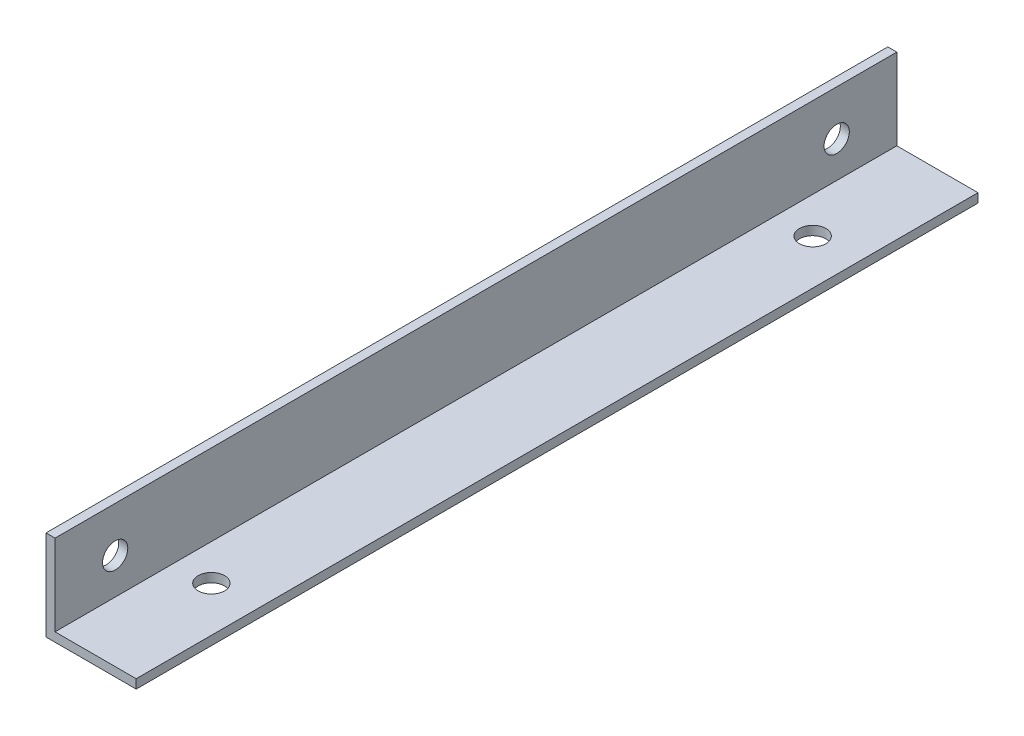
ISO-10303-21;
HEADER;
FILE_DESCRIPTION(('STEP AP214'),'2;1');
FILE_NAME('part.step','',(''),(''),'','','');
FILE_SCHEMA(('AUTOMOTIVE_DESIGN { 1 0 10303 214 1 1 1 1 }'));
ENDSEC;
DATA;
#1=APPLICATION_CONTEXT('core data for automotive mechanical design processes');
#2=APPLICATION_PROTOCOL_DEFINITION('international standard','automotive_design',2000,#1);
#3=PRODUCT_CONTEXT('',#1,'mechanical');
#4=PRODUCT('Part','Part','',(#3));
#5=PRODUCT_RELATED_PRODUCT_CATEGORY('part','',(#4));
#6=PRODUCT_DEFINITION_FORMATION('','',#4);
#7=PRODUCT_DEFINITION_CONTEXT('part definition',#1,'design');
#8=PRODUCT_DEFINITION('design','',#6,#7);
#9=PRODUCT_DEFINITION_SHAPE('','',#8);
#10=(LENGTH_UNIT() NAMED_UNIT(*) SI_UNIT(.MILLI.,.METRE.));
#11=(NAMED_UNIT(*) PLANE_ANGLE_UNIT() SI_UNIT($,.RADIAN.));
#12=(NAMED_UNIT(*) SI_UNIT($,.STERADIAN.) SOLID_ANGLE_UNIT());
#13=UNCERTAINTY_MEASURE_WITH_UNIT(LENGTH_MEASURE(1.E-05),#10,'distance_accuracy_value','');
#14=(GEOMETRIC_REPRESENTATION_CONTEXT(3) GLOBAL_UNCERTAINTY_ASSIGNED_CONTEXT((#13)) GLOBAL_UNIT_ASSIGNED_CONTEXT((#10,
#11,#12)) REPRESENTATION_CONTEXT('',''));
#15=CARTESIAN_POINT('',(0.,0.,0.));
#16=DIRECTION('',(0.,0.,1.));
#17=DIRECTION('',(1.,0.,0.));
#18=AXIS2_PLACEMENT_3D('',#15,#16,#17);
#19=CARTESIAN_POINT('',(15.,0.,140.));
#20=DIRECTION('',(0.,1.,0.));
#21=DIRECTION('',(-1.,0.,0.));
#22=AXIS2_PLACEMENT_3D('',#19,#20,#21);
#23=PLANE('',#22);
#24=CARTESIAN_POINT('',(7.5,0.,120.));
#25=DIRECTION('',(0.,-1.,0.));
#26=DIRECTION('',(1.,0.,0.));
#27=AXIS2_PLACEMENT_3D('',#24,#25,#26);
#28=CIRCLE('',#27,2.2);
#29=CARTESIAN_POINT('',(9.7,0.,120.));
#30=VERTEX_POINT('',#29);
#31=EDGE_CURVE('E137',#30,#30,#28,.T.);
#32=ORIENTED_EDGE('',*,*,#31,.F.);
#33=EDGE_LOOP('',(#32));
#34=FACE_BOUND('',#33,.T.);
#35=CARTESIAN_POINT('',(7.5,0.,20.));
#36=DIRECTION('',(0.,-1.,0.));
#37=DIRECTION('',(1.,0.,0.));
#38=AXIS2_PLACEMENT_3D('',#35,#36,#37);
#39=CIRCLE('',#38,2.2);
#40=CARTESIAN_POINT('',(9.7,0.,20.));
#41=VERTEX_POINT('',#40);
#42=EDGE_CURVE('E143',#41,#41,#39,.T.);
#43=ORIENTED_EDGE('',*,*,#42,.F.);
#44=EDGE_LOOP('',(#43));
#45=FACE_BOUND('',#44,.T.);
#46=DIRECTION('',(1.,0.,0.));
#47=VECTOR('',#46,1.);
#48=CARTESIAN_POINT('',(15.,0.,0.));
#49=LINE('',#48,#47);
#50=CARTESIAN_POINT('',(0.,0.,0.));
#51=VERTEX_POINT('',#50);
#52=CARTESIAN_POINT('',(15.,0.,0.));
#53=VERTEX_POINT('',#52);
#54=EDGE_CURVE('E119',#51,#53,#49,.T.);
#55=ORIENTED_EDGE('',*,*,#54,.T.);
#56=DIRECTION('',(0.,0.,-1.));
#57=VECTOR('',#56,1.);
#58=CARTESIAN_POINT('',(15.,0.,140.));
#59=LINE('',#58,#57);
#60=CARTESIAN_POINT('',(15.,0.,140.));
#61=VERTEX_POINT('',#60);
#62=EDGE_CURVE('E11',#61,#53,#59,.T.);
#63=ORIENTED_EDGE('',*,*,#62,.F.);
#64=DIRECTION('',(1.,0.,0.));
#65=VECTOR('',#64,1.);
#66=CARTESIAN_POINT('',(15.,0.,140.));
#67=LINE('',#66,#65);
#68=CARTESIAN_POINT('',(0.,0.,140.));
#69=VERTEX_POINT('',#68);
#70=EDGE_CURVE('E130',#69,#61,#67,.T.);
#71=ORIENTED_EDGE('',*,*,#70,.F.);
#72=DIRECTION('',(0.,0.,-1.));
#73=VECTOR('',#72,1.);
#74=CARTESIAN_POINT('',(0.,0.,140.));
#75=LINE('',#74,#73);
#76=EDGE_CURVE('E115',#69,#51,#75,.T.);
#77=ORIENTED_EDGE('',*,*,#76,.T.);
#78=EDGE_LOOP('',(#55,#63,#71,#77));
#79=FACE_BOUND('',#78,.T.);
#80=ADVANCED_FACE('F33',(#34,#45,#79),#23,.F.);
#81=CARTESIAN_POINT('',(15.,1.5,140.));
#82=DIRECTION('',(-1.,0.,0.));
#83=DIRECTION('',(0.,0.,1.));
#84=AXIS2_PLACEMENT_3D('',#81,#82,#83);
#85=PLANE('',#84);
#86=DIRECTION('',(0.,1.,0.));
#87=VECTOR('',#86,1.);
#88=CARTESIAN_POINT('',(15.,1.5,0.));
#89=LINE('',#88,#87);
#90=CARTESIAN_POINT('',(15.,1.5,0.));
#91=VERTEX_POINT('',#90);
#92=EDGE_CURVE('E122',#53,#91,#89,.T.);
#93=ORIENTED_EDGE('',*,*,#92,.T.);
#94=DIRECTION('',(0.,0.,-1.));
#95=VECTOR('',#94,1.);
#96=CARTESIAN_POINT('',(15.,1.5,140.));
#97=LINE('',#96,#95);
#98=CARTESIAN_POINT('',(15.,1.5,140.));
#99=VERTEX_POINT('',#98);
#100=EDGE_CURVE('E42',#99,#91,#97,.T.);
#101=ORIENTED_EDGE('',*,*,#100,.F.);
#102=DIRECTION('',(0.,1.,0.));
#103=VECTOR('',#102,1.);
#104=CARTESIAN_POINT('',(15.,1.5,140.));
#105=LINE('',#104,#103);
#106=EDGE_CURVE('E88',#61,#99,#105,.T.);
#107=ORIENTED_EDGE('',*,*,#106,.F.);
#108=ORIENTED_EDGE('',*,*,#62,.T.);
#109=EDGE_LOOP('',(#93,#101,#107,#108));
#110=FACE_BOUND('',#109,.T.);
#111=ADVANCED_FACE('F163',(#110),#85,.F.);
#112=CARTESIAN_POINT('',(1.5,1.5,140.));
#113=DIRECTION('',(0.,-1.,0.));
#114=DIRECTION('',(0.,0.,-1.));
#115=AXIS2_PLACEMENT_3D('',#112,#113,#114);
#116=PLANE('',#115);
#117=CARTESIAN_POINT('',(7.5,1.5,120.));
#118=DIRECTION('',(0.,-1.,0.));
#119=DIRECTION('',(0.,0.,-1.));
#120=AXIS2_PLACEMENT_3D('',#117,#118,#119);
#121=CIRCLE('',#120,2.2);
#122=CARTESIAN_POINT('',(7.5,1.5,117.8));
#123=VERTEX_POINT('',#122);
#124=EDGE_CURVE('E36',#123,#123,#121,.T.);
#125=ORIENTED_EDGE('',*,*,#124,.T.);
#126=EDGE_LOOP('',(#125));
#127=FACE_BOUND('',#126,.T.);
#128=CARTESIAN_POINT('',(7.5,1.5,20.));
#129=DIRECTION('',(0.,-1.,0.));
#130=DIRECTION('',(0.,0.,-1.));
#131=AXIS2_PLACEMENT_3D('',#128,#129,#130);
#132=CIRCLE('',#131,2.2);
#133=CARTESIAN_POINT('',(7.5,1.5,17.8));
#134=VERTEX_POINT('',#133);
#135=EDGE_CURVE('E135',#134,#134,#132,.T.);
#136=ORIENTED_EDGE('',*,*,#135,.T.);
#137=EDGE_LOOP('',(#136));
#138=FACE_BOUND('',#137,.T.);
#139=DIRECTION('',(-1.,0.,0.));
#140=VECTOR('',#139,1.);
#141=CARTESIAN_POINT('',(1.5,1.5,0.));
#142=LINE('',#141,#140);
#143=CARTESIAN_POINT('',(1.5,1.5,0.));
#144=VERTEX_POINT('',#143);
#145=EDGE_CURVE('E125',#91,#144,#142,.T.);
#146=ORIENTED_EDGE('',*,*,#145,.T.);
#147=DIRECTION('',(0.,0.,-1.));
#148=VECTOR('',#147,1.);
#149=CARTESIAN_POINT('',(1.5,1.5,140.));
#150=LINE('',#149,#148);
#151=CARTESIAN_POINT('',(1.5,1.5,140.));
#152=VERTEX_POINT('',#151);
#153=EDGE_CURVE('E110',#152,#144,#150,.T.);
#154=ORIENTED_EDGE('',*,*,#153,.F.);
#155=DIRECTION('',(-1.,0.,0.));
#156=VECTOR('',#155,1.);
#157=CARTESIAN_POINT('',(1.5,1.5,140.));
#158=LINE('',#157,#156);
#159=EDGE_CURVE('E101',#99,#152,#158,.T.);
#160=ORIENTED_EDGE('',*,*,#159,.F.);
#161=ORIENTED_EDGE('',*,*,#100,.T.);
#162=EDGE_LOOP('',(#146,#154,#160,#161));
#163=FACE_BOUND('',#162,.T.);
#164=ADVANCED_FACE('F166',(#127,#138,#163),#116,.F.);
#165=CARTESIAN_POINT('',(1.5,15.,140.));
#166=DIRECTION('',(-1.,0.,0.));
#167=DIRECTION('',(0.,-1.,0.));
#168=AXIS2_PLACEMENT_3D('',#165,#166,#167);
#169=PLANE('',#168);
#170=CARTESIAN_POINT('',(1.5,7.5,130.));
#171=DIRECTION('',(-1.,0.,0.));
#172=DIRECTION('',(0.,-1.,0.));
#173=AXIS2_PLACEMENT_3D('',#170,#171,#172);
#174=CIRCLE('',#173,2.09999999999999);
#175=CARTESIAN_POINT('',(1.5,5.40000000000001,130.));
#176=VERTEX_POINT('',#175);
#177=EDGE_CURVE('E123',#176,#176,#174,.T.);
#178=ORIENTED_EDGE('',*,*,#177,.T.);
#179=EDGE_LOOP('',(#178));
#180=FACE_BOUND('',#179,.T.);
#181=CARTESIAN_POINT('',(1.5,7.49999999999998,10.));
#182=DIRECTION('',(-1.,0.,0.));
#183=DIRECTION('',(0.,-1.,0.));
#184=AXIS2_PLACEMENT_3D('',#181,#182,#183);
#185=CIRCLE('',#184,2.1);
#186=CARTESIAN_POINT('',(1.5,5.39999999999998,10.));
#187=VERTEX_POINT('',#186);
#188=EDGE_CURVE('E153',#187,#187,#185,.T.);
#189=ORIENTED_EDGE('',*,*,#188,.T.);
#190=EDGE_LOOP('',(#189));
#191=FACE_BOUND('',#190,.T.);
#192=DIRECTION('',(0.,1.,0.));
#193=VECTOR('',#192,1.);
#194=CARTESIAN_POINT('',(1.5,15.,0.));
#195=LINE('',#194,#193);
#196=CARTESIAN_POINT('',(1.5,15.,0.));
#197=VERTEX_POINT('',#196);
#198=EDGE_CURVE('E109',#144,#197,#195,.T.);
#199=ORIENTED_EDGE('',*,*,#198,.T.);
#200=DIRECTION('',(0.,0.,-1.));
#201=VECTOR('',#200,1.);
#202=CARTESIAN_POINT('',(1.5,15.,140.));
#203=LINE('',#202,#201);
#204=CARTESIAN_POINT('',(1.5,15.,140.));
#205=VERTEX_POINT('',#204);
#206=EDGE_CURVE('E106',#205,#197,#203,.T.);
#207=ORIENTED_EDGE('',*,*,#206,.F.);
#208=DIRECTION('',(0.,1.,0.));
#209=VECTOR('',#208,1.);
#210=CARTESIAN_POINT('',(1.5,15.,140.));
#211=LINE('',#210,#209);
#212=EDGE_CURVE('E95',#152,#205,#211,.T.);
#213=ORIENTED_EDGE('',*,*,#212,.F.);
#214=ORIENTED_EDGE('',*,*,#153,.T.);
#215=EDGE_LOOP('',(#199,#207,#213,#214));
#216=FACE_BOUND('',#215,.T.);
#217=ADVANCED_FACE('F107',(#180,#191,#216),#169,.F.);
#218=CARTESIAN_POINT('',(0.,15.,140.));
#219=DIRECTION('',(0.,-1.,0.));
#220=DIRECTION('',(0.,0.,-1.));
#221=AXIS2_PLACEMENT_3D('',#218,#219,#220);
#222=PLANE('',#221);
#223=DIRECTION('',(-1.,0.,0.));
#224=VECTOR('',#223,1.);
#225=CARTESIAN_POINT('',(0.,15.,0.));
#226=LINE('',#225,#224);
#227=CARTESIAN_POINT('',(0.,15.,0.));
#228=VERTEX_POINT('',#227);
#229=EDGE_CURVE('E74',#197,#228,#226,.T.);
#230=ORIENTED_EDGE('',*,*,#229,.T.);
#231=DIRECTION('',(0.,0.,-1.));
#232=VECTOR('',#231,1.);
#233=CARTESIAN_POINT('',(0.,15.,140.));
#234=LINE('',#233,#232);
#235=CARTESIAN_POINT('',(0.,15.,140.));
#236=VERTEX_POINT('',#235);
#237=EDGE_CURVE('E111',#236,#228,#234,.T.);
#238=ORIENTED_EDGE('',*,*,#237,.F.);
#239=DIRECTION('',(-1.,0.,0.));
#240=VECTOR('',#239,1.);
#241=CARTESIAN_POINT('',(0.,15.,140.));
#242=LINE('',#241,#240);
#243=EDGE_CURVE('E99',#205,#236,#242,.T.);
#244=ORIENTED_EDGE('',*,*,#243,.F.);
#245=ORIENTED_EDGE('',*,*,#206,.T.);
#246=EDGE_LOOP('',(#230,#238,#244,#245));
#247=FACE_BOUND('',#246,.T.);
#248=ADVANCED_FACE('F113',(#247),#222,.F.);
#249=CARTESIAN_POINT('',(0.,0.,140.));
#250=DIRECTION('',(1.,0.,0.));
#251=DIRECTION('',(0.,0.,-1.));
#252=AXIS2_PLACEMENT_3D('',#249,#250,#251);
#253=PLANE('',#252);
#254=CARTESIAN_POINT('',(0.,7.5,130.));
#255=DIRECTION('',(-1.,0.,0.));
#256=DIRECTION('',(0.,0.,1.));
#257=AXIS2_PLACEMENT_3D('',#254,#255,#256);
#258=CIRCLE('',#257,2.09999999999999);
#259=CARTESIAN_POINT('',(0.,7.5,132.1));
#260=VERTEX_POINT('',#259);
#261=EDGE_CURVE('E150',#260,#260,#258,.T.);
#262=ORIENTED_EDGE('',*,*,#261,.F.);
#263=EDGE_LOOP('',(#262));
#264=FACE_BOUND('',#263,.T.);
#265=CARTESIAN_POINT('',(0.,7.49999999999998,10.));
#266=DIRECTION('',(-1.,0.,0.));
#267=DIRECTION('',(0.,0.,1.));
#268=AXIS2_PLACEMENT_3D('',#265,#266,#267);
#269=CIRCLE('',#268,2.1);
#270=CARTESIAN_POINT('',(0.,7.49999999999998,12.1));
#271=VERTEX_POINT('',#270);
#272=EDGE_CURVE('E141',#271,#271,#269,.T.);
#273=ORIENTED_EDGE('',*,*,#272,.F.);
#274=EDGE_LOOP('',(#273));
#275=FACE_BOUND('',#274,.T.);
#276=DIRECTION('',(0.,-1.,0.));
#277=VECTOR('',#276,1.);
#278=CARTESIAN_POINT('',(0.,0.,0.));
#279=LINE('',#278,#277);
#280=EDGE_CURVE('E80',#228,#51,#279,.T.);
#281=ORIENTED_EDGE('',*,*,#280,.T.);
#282=ORIENTED_EDGE('',*,*,#76,.F.);
#283=DIRECTION('',(0.,-1.,0.));
#284=VECTOR('',#283,1.);
#285=CARTESIAN_POINT('',(0.,0.,140.));
#286=LINE('',#285,#284);
#287=EDGE_CURVE('E51',#236,#69,#286,.T.);
#288=ORIENTED_EDGE('',*,*,#287,.F.);
#289=ORIENTED_EDGE('',*,*,#237,.T.);
#290=EDGE_LOOP('',(#281,#282,#288,#289));
#291=FACE_BOUND('',#290,.T.);
#292=ADVANCED_FACE('F171',(#264,#275,#291),#253,.F.);
#293=CARTESIAN_POINT('',(0.,0.,140.));
#294=DIRECTION('',(0.,0.,-1.));
#295=DIRECTION('',(-1.,0.,0.));
#296=AXIS2_PLACEMENT_3D('',#293,#294,#295);
#297=PLANE('',#296);
#298=ORIENTED_EDGE('',*,*,#70,.T.);
#299=ORIENTED_EDGE('',*,*,#106,.T.);
#300=ORIENTED_EDGE('',*,*,#159,.T.);
#301=ORIENTED_EDGE('',*,*,#212,.T.);
#302=ORIENTED_EDGE('',*,*,#243,.T.);
#303=ORIENTED_EDGE('',*,*,#287,.T.);
#304=EDGE_LOOP('',(#298,#299,#300,#301,#302,#303));
#305=FACE_BOUND('',#304,.T.);
#306=ADVANCED_FACE('F97',(#305),#297,.F.);
#307=CARTESIAN_POINT('',(0.,0.,0.));
#308=DIRECTION('',(0.,0.,-1.));
#309=DIRECTION('',(-1.,0.,0.));
#310=AXIS2_PLACEMENT_3D('',#307,#308,#309);
#311=PLANE('',#310);
#312=ORIENTED_EDGE('',*,*,#54,.F.);
#313=ORIENTED_EDGE('',*,*,#280,.F.);
#314=ORIENTED_EDGE('',*,*,#229,.F.);
#315=ORIENTED_EDGE('',*,*,#198,.F.);
#316=ORIENTED_EDGE('',*,*,#145,.F.);
#317=ORIENTED_EDGE('',*,*,#92,.F.);
#318=EDGE_LOOP('',(#312,#313,#314,#315,#316,#317));
#319=FACE_BOUND('',#318,.T.);
#320=ADVANCED_FACE('F169',(#319),#311,.T.);
#321=CARTESIAN_POINT('',(140.,7.49999999999998,10.));
#322=DIRECTION('',(-1.,0.,0.));
#323=DIRECTION('',(0.,0.,1.));
#324=AXIS2_PLACEMENT_3D('',#321,#322,#323);
#325=CYLINDRICAL_SURFACE('',#324,2.1);
#326=ORIENTED_EDGE('',*,*,#272,.T.);
#327=EDGE_LOOP('',(#326));
#328=FACE_BOUND('',#327,.T.);
#329=ORIENTED_EDGE('',*,*,#188,.F.);
#330=EDGE_LOOP('',(#329));
#331=FACE_BOUND('',#330,.T.);
#332=ADVANCED_FACE('F203',(#328,#331),#325,.F.);
#333=CARTESIAN_POINT('',(140.,7.5,130.));
#334=DIRECTION('',(-1.,0.,0.));
#335=DIRECTION('',(0.,0.,1.));
#336=AXIS2_PLACEMENT_3D('',#333,#334,#335);
#337=CYLINDRICAL_SURFACE('',#336,2.09999999999999);
#338=ORIENTED_EDGE('',*,*,#261,.T.);
#339=EDGE_LOOP('',(#338));
#340=FACE_BOUND('',#339,.T.);
#341=ORIENTED_EDGE('',*,*,#177,.F.);
#342=EDGE_LOOP('',(#341));
#343=FACE_BOUND('',#342,.T.);
#344=ADVANCED_FACE('F196',(#340,#343),#337,.F.);
#345=CARTESIAN_POINT('',(7.50000000000001,140.,20.));
#346=DIRECTION('',(0.,-1.,0.));
#347=DIRECTION('',(1.,0.,0.));
#348=AXIS2_PLACEMENT_3D('',#345,#346,#347);
#349=CYLINDRICAL_SURFACE('',#348,2.2);
#350=ORIENTED_EDGE('',*,*,#42,.T.);
#351=EDGE_LOOP('',(#350));
#352=FACE_BOUND('',#351,.T.);
#353=ORIENTED_EDGE('',*,*,#135,.F.);
#354=EDGE_LOOP('',(#353));
#355=FACE_BOUND('',#354,.T.);
#356=ADVANCED_FACE('F192',(#352,#355),#349,.F.);
#357=CARTESIAN_POINT('',(7.50000000000001,140.,120.));
#358=DIRECTION('',(0.,-1.,0.));
#359=DIRECTION('',(1.,0.,0.));
#360=AXIS2_PLACEMENT_3D('',#357,#358,#359);
#361=CYLINDRICAL_SURFACE('',#360,2.2);
#362=ORIENTED_EDGE('',*,*,#31,.T.);
#363=EDGE_LOOP('',(#362));
#364=FACE_BOUND('',#363,.T.);
#365=ORIENTED_EDGE('',*,*,#124,.F.);
#366=EDGE_LOOP('',(#365));
#367=FACE_BOUND('',#366,.T.);
#368=ADVANCED_FACE('F195',(#364,#367),#361,.F.);
#369=CLOSED_SHELL('',(#80,#111,#164,#217,#248,#292,#306,#320,#332,#344,#356,#368));
#370=MANIFOLD_SOLID_BREP('B2',#369);
#371=ADVANCED_BREP_SHAPE_REPRESENTATION('',(#18,#370),#14);
#372=SHAPE_DEFINITION_REPRESENTATION(#9,#371);
ENDSEC;
END-ISO-10303-21;
